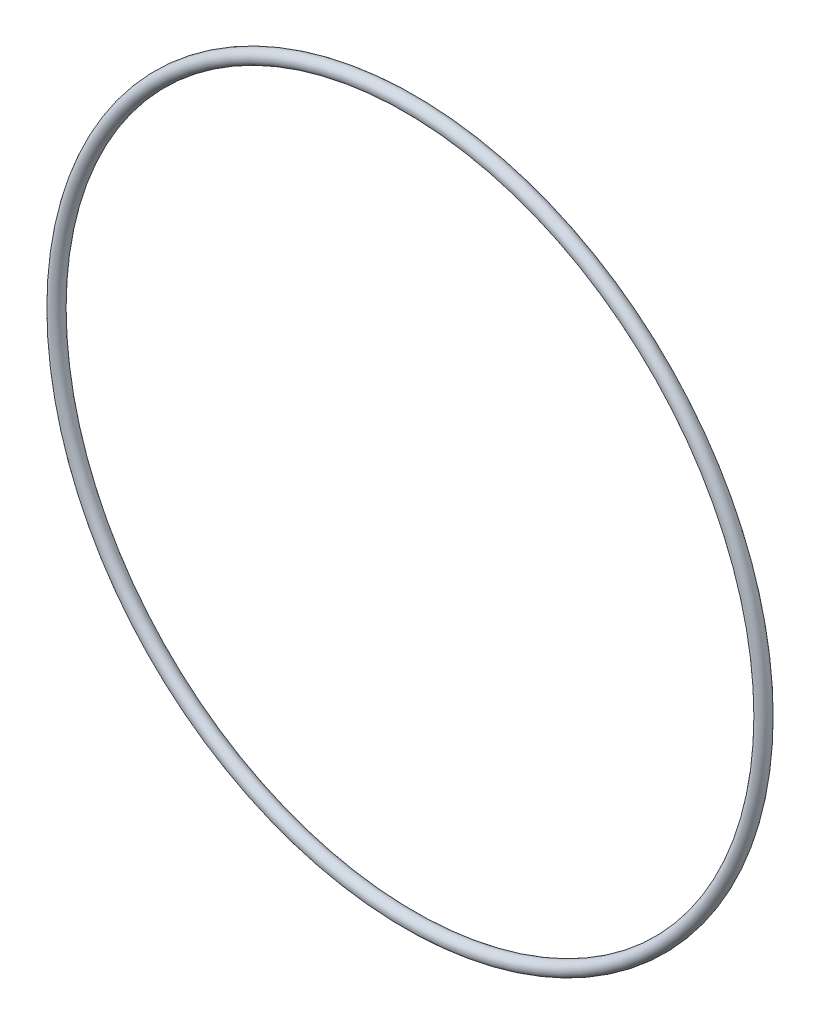
ISO-10303-21;
HEADER;
FILE_DESCRIPTION(('STEP AP214'),'2;1');
FILE_NAME('part.step','',(''),(''),'','','');
FILE_SCHEMA(('AUTOMOTIVE_DESIGN { 1 0 10303 214 1 1 1 1 }'));
ENDSEC;
DATA;
#1=APPLICATION_CONTEXT('core data for automotive mechanical design processes');
#2=APPLICATION_PROTOCOL_DEFINITION('international standard','automotive_design',2000,#1);
#3=PRODUCT_CONTEXT('',#1,'mechanical');
#4=PRODUCT('Part','Part','',(#3));
#5=PRODUCT_RELATED_PRODUCT_CATEGORY('part','',(#4));
#6=PRODUCT_DEFINITION_FORMATION('','',#4);
#7=PRODUCT_DEFINITION_CONTEXT('part definition',#1,'design');
#8=PRODUCT_DEFINITION('design','',#6,#7);
#9=PRODUCT_DEFINITION_SHAPE('','',#8);
#10=(LENGTH_UNIT() NAMED_UNIT(*) SI_UNIT(.MILLI.,.METRE.));
#11=(NAMED_UNIT(*) PLANE_ANGLE_UNIT() SI_UNIT($,.RADIAN.));
#12=(NAMED_UNIT(*) SI_UNIT($,.STERADIAN.) SOLID_ANGLE_UNIT());
#13=UNCERTAINTY_MEASURE_WITH_UNIT(LENGTH_MEASURE(1.E-05),#10,'distance_accuracy_value','');
#14=(GEOMETRIC_REPRESENTATION_CONTEXT(3) GLOBAL_UNCERTAINTY_ASSIGNED_CONTEXT((#13)) GLOBAL_UNIT_ASSIGNED_CONTEXT((#10,
#11,#12)) REPRESENTATION_CONTEXT('',''));
#15=CARTESIAN_POINT('',(0.,0.,0.));
#16=DIRECTION('',(0.,0.,1.));
#17=DIRECTION('',(1.,0.,0.));
#18=AXIS2_PLACEMENT_3D('',#15,#16,#17);
#19=CARTESIAN_POINT('',(0.,0.,0.));
#20=DIRECTION('',(0.,0.,1.));
#21=DIRECTION('',(1.,0.,0.));
#22=AXIS2_PLACEMENT_3D('',#19,#20,#21);
#23=TOROIDAL_SURFACE('',#22,67.818,1.30810000000001);
#24=CARTESIAN_POINT('',(69.1261,0.,0.));
#25=VERTEX_POINT('',#24);
#26=VERTEX_LOOP('',#25);
#27=FACE_BOUND('',#26,.T.);
#28=ADVANCED_FACE('F30',(#27),#23,.T.);
#29=CLOSED_SHELL('',(#28));
#30=MANIFOLD_SOLID_BREP('B2',#29);
#31=ADVANCED_BREP_SHAPE_REPRESENTATION('',(#18,#30),#14);
#32=SHAPE_DEFINITION_REPRESENTATION(#9,#31);
ENDSEC;
END-ISO-10303-21;
